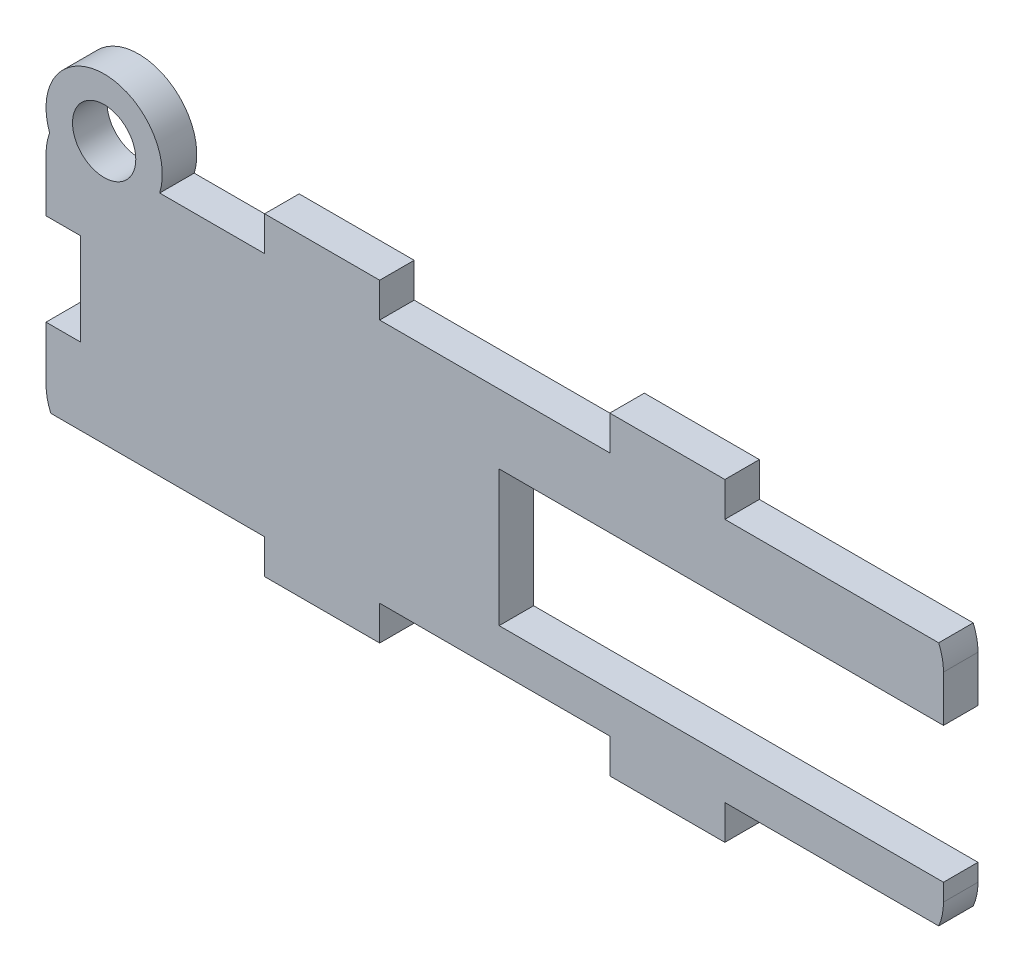
ISO-10303-21;
HEADER;
FILE_DESCRIPTION(('STEP AP214'),'2;1');
FILE_NAME('part.step','',(''),(''),'','','');
FILE_SCHEMA(('AUTOMOTIVE_DESIGN { 1 0 10303 214 1 1 1 1 }'));
ENDSEC;
DATA;
#1=APPLICATION_CONTEXT('core data for automotive mechanical design processes');
#2=APPLICATION_PROTOCOL_DEFINITION('international standard','automotive_design',2000,#1);
#3=PRODUCT_CONTEXT('',#1,'mechanical');
#4=PRODUCT('Part','Part','',(#3));
#5=PRODUCT_RELATED_PRODUCT_CATEGORY('part','',(#4));
#6=PRODUCT_DEFINITION_FORMATION('','',#4);
#7=PRODUCT_DEFINITION_CONTEXT('part definition',#1,'design');
#8=PRODUCT_DEFINITION('design','',#6,#7);
#9=PRODUCT_DEFINITION_SHAPE('','',#8);
#10=(LENGTH_UNIT() NAMED_UNIT(*) SI_UNIT(.MILLI.,.METRE.));
#11=(NAMED_UNIT(*) PLANE_ANGLE_UNIT() SI_UNIT($,.RADIAN.));
#12=(NAMED_UNIT(*) SI_UNIT($,.STERADIAN.) SOLID_ANGLE_UNIT());
#13=UNCERTAINTY_MEASURE_WITH_UNIT(LENGTH_MEASURE(1.E-05),#10,'distance_accuracy_value','');
#14=(GEOMETRIC_REPRESENTATION_CONTEXT(3) GLOBAL_UNCERTAINTY_ASSIGNED_CONTEXT((#13)) GLOBAL_UNIT_ASSIGNED_CONTEXT((#10,
#11,#12)) REPRESENTATION_CONTEXT('',''));
#15=CARTESIAN_POINT('',(0.,0.,0.));
#16=DIRECTION('',(0.,0.,1.));
#17=DIRECTION('',(1.,0.,0.));
#18=AXIS2_PLACEMENT_3D('',#15,#16,#17);
#19=CARTESIAN_POINT('',(-26.,2.00000000000004,3.));
#20=DIRECTION('',(1.,0.,0.));
#21=DIRECTION('',(0.,0.,-1.));
#22=AXIS2_PLACEMENT_3D('',#19,#20,#21);
#23=PLANE('',#22);
#24=DIRECTION('',(0.,0.,1.));
#25=VECTOR('',#24,1.);
#26=CARTESIAN_POINT('',(-26.,6.65592079454651,0.));
#27=LINE('',#26,#25);
#28=CARTESIAN_POINT('',(-26.,6.65592079454651,0.));
#29=VERTEX_POINT('',#28);
#30=CARTESIAN_POINT('',(-26.,6.65592079454651,3.));
#31=VERTEX_POINT('',#30);
#32=EDGE_CURVE('E252',#29,#31,#27,.T.);
#33=ORIENTED_EDGE('',*,*,#32,.F.);
#34=DIRECTION('',(0.,-1.,0.));
#35=VECTOR('',#34,1.);
#36=CARTESIAN_POINT('',(-26.,2.00000000000004,0.));
#37=LINE('',#36,#35);
#38=CARTESIAN_POINT('',(-26.,2.,0.));
#39=VERTEX_POINT('',#38);
#40=EDGE_CURVE('E264',#29,#39,#37,.T.);
#41=ORIENTED_EDGE('',*,*,#40,.T.);
#42=DIRECTION('',(0.,0.,-1.));
#43=VECTOR('',#42,1.);
#44=CARTESIAN_POINT('',(-26.,2.,3.));
#45=LINE('',#44,#43);
#46=CARTESIAN_POINT('',(-26.,2.,3.));
#47=VERTEX_POINT('',#46);
#48=EDGE_CURVE('E360',#47,#39,#45,.T.);
#49=ORIENTED_EDGE('',*,*,#48,.F.);
#50=DIRECTION('',(0.,-1.,0.));
#51=VECTOR('',#50,1.);
#52=CARTESIAN_POINT('',(-26.,2.00000000000004,3.));
#53=LINE('',#52,#51);
#54=EDGE_CURVE('E266',#31,#47,#53,.T.);
#55=ORIENTED_EDGE('',*,*,#54,.F.);
#56=EDGE_LOOP('',(#33,#41,#49,#55));
#57=FACE_BOUND('',#56,.T.);
#58=ADVANCED_FACE('F33',(#57),#23,.F.);
#59=CARTESIAN_POINT('',(47.,19.311841589093,3.));
#60=DIRECTION('',(0.,0.,-1.));
#61=DIRECTION('',(-1.,0.,0.));
#62=AXIS2_PLACEMENT_3D('',#59,#60,#61);
#63=PLANE('',#62);
#64=CARTESIAN_POINT('',(-20.9460971389768,22.811841589093,3.));
#65=DIRECTION('',(0.,0.,1.));
#66=DIRECTION('',(1.,0.,0.));
#67=AXIS2_PLACEMENT_3D('',#64,#65,#66);
#68=CIRCLE('',#67,2.75);
#69=CARTESIAN_POINT('',(-18.1960971389768,22.811841589093,3.));
#70=VERTEX_POINT('',#69);
#71=EDGE_CURVE('E267',#70,#70,#68,.T.);
#72=ORIENTED_EDGE('',*,*,#71,.F.);
#73=EDGE_LOOP('',(#72));
#74=FACE_BOUND('',#73,.T.);
#75=DIRECTION('',(-1.,0.,0.));
#76=VECTOR('',#75,1.);
#77=CARTESIAN_POINT('',(-23.0000000000001,6.65592079454651,3.));
#78=LINE('',#77,#76);
#79=CARTESIAN_POINT('',(-23.0000000000001,6.65592079454651,3.));
#80=VERTEX_POINT('',#79);
#81=EDGE_CURVE('E592',#80,#31,#78,.T.);
#82=ORIENTED_EDGE('',*,*,#81,.T.);
#83=ORIENTED_EDGE('',*,*,#54,.T.);
#84=CARTESIAN_POINT('',(-21.,2.,3.));
#85=DIRECTION('',(0.,0.,1.));
#86=DIRECTION('',(-1.,0.,0.));
#87=AXIS2_PLACEMENT_3D('',#84,#85,#86);
#88=CIRCLE('',#87,5.);
#89=CARTESIAN_POINT('',(-25.5825756949558,0.,3.));
#90=VERTEX_POINT('',#89);
#91=EDGE_CURVE('E468',#47,#90,#88,.T.);
#92=ORIENTED_EDGE('',*,*,#91,.T.);
#93=DIRECTION('',(1.,0.,0.));
#94=VECTOR('',#93,1.);
#95=CARTESIAN_POINT('',(-6.99999999999999,0.,3.));
#96=LINE('',#95,#94);
#97=CARTESIAN_POINT('',(-6.99999999999999,0.,3.));
#98=VERTEX_POINT('',#97);
#99=EDGE_CURVE('E470',#90,#98,#96,.T.);
#100=ORIENTED_EDGE('',*,*,#99,.T.);
#101=DIRECTION('',(0.,-1.,0.));
#102=VECTOR('',#101,1.);
#103=CARTESIAN_POINT('',(-6.99999999999999,0.,3.));
#104=LINE('',#103,#102);
#105=CARTESIAN_POINT('',(-6.99999999999999,-3.,3.));
#106=VERTEX_POINT('',#105);
#107=EDGE_CURVE('E472',#98,#106,#104,.T.);
#108=ORIENTED_EDGE('',*,*,#107,.T.);
#109=DIRECTION('',(1.,0.,0.));
#110=VECTOR('',#109,1.);
#111=CARTESIAN_POINT('',(-6.99999999999999,-3.,3.));
#112=LINE('',#111,#110);
#113=CARTESIAN_POINT('',(3.00000000000001,-3.,3.));
#114=VERTEX_POINT('',#113);
#115=EDGE_CURVE('E474',#106,#114,#112,.T.);
#116=ORIENTED_EDGE('',*,*,#115,.T.);
#117=DIRECTION('',(0.,1.,0.));
#118=VECTOR('',#117,1.);
#119=CARTESIAN_POINT('',(3.00000000000001,-3.,3.));
#120=LINE('',#119,#118);
#121=CARTESIAN_POINT('',(3.00000000000001,0.,3.));
#122=VERTEX_POINT('',#121);
#123=EDGE_CURVE('E476',#114,#122,#120,.T.);
#124=ORIENTED_EDGE('',*,*,#123,.T.);
#125=DIRECTION('',(1.,0.,0.));
#126=VECTOR('',#125,1.);
#127=CARTESIAN_POINT('',(3.00000000000001,0.,3.));
#128=LINE('',#127,#126);
#129=CARTESIAN_POINT('',(23.,0.,3.));
#130=VERTEX_POINT('',#129);
#131=EDGE_CURVE('E478',#122,#130,#128,.T.);
#132=ORIENTED_EDGE('',*,*,#131,.T.);
#133=DIRECTION('',(0.,-1.,0.));
#134=VECTOR('',#133,1.);
#135=CARTESIAN_POINT('',(23.,-3.,3.));
#136=LINE('',#135,#134);
#137=CARTESIAN_POINT('',(23.,-3.,3.));
#138=VERTEX_POINT('',#137);
#139=EDGE_CURVE('E480',#130,#138,#136,.T.);
#140=ORIENTED_EDGE('',*,*,#139,.T.);
#141=DIRECTION('',(1.,0.,0.));
#142=VECTOR('',#141,1.);
#143=CARTESIAN_POINT('',(23.,-3.,3.));
#144=LINE('',#143,#142);
#145=CARTESIAN_POINT('',(33.,-3.,3.));
#146=VERTEX_POINT('',#145);
#147=EDGE_CURVE('E482',#138,#146,#144,.T.);
#148=ORIENTED_EDGE('',*,*,#147,.T.);
#149=DIRECTION('',(0.,1.,0.));
#150=VECTOR('',#149,1.);
#151=CARTESIAN_POINT('',(33.,-3.,3.));
#152=LINE('',#151,#150);
#153=CARTESIAN_POINT('',(33.,0.,3.));
#154=VERTEX_POINT('',#153);
#155=EDGE_CURVE('E484',#146,#154,#152,.T.);
#156=ORIENTED_EDGE('',*,*,#155,.T.);
#157=DIRECTION('',(1.,0.,0.));
#158=VECTOR('',#157,1.);
#159=CARTESIAN_POINT('',(33.,0.,3.));
#160=LINE('',#159,#158);
#161=CARTESIAN_POINT('',(51.5825756949558,0.,3.));
#162=VERTEX_POINT('',#161);
#163=EDGE_CURVE('E486',#154,#162,#160,.T.);
#164=ORIENTED_EDGE('',*,*,#163,.T.);
#165=CARTESIAN_POINT('',(47.,2.,3.));
#166=DIRECTION('',(0.,0.,1.));
#167=DIRECTION('',(1.,0.,0.));
#168=AXIS2_PLACEMENT_3D('',#165,#166,#167);
#169=CIRCLE('',#168,5.);
#170=CARTESIAN_POINT('',(52.,2.00000000000004,3.));
#171=VERTEX_POINT('',#170);
#172=EDGE_CURVE('E488',#162,#171,#169,.T.);
#173=ORIENTED_EDGE('',*,*,#172,.T.);
#174=DIRECTION('',(0.,1.,0.));
#175=VECTOR('',#174,1.);
#176=CARTESIAN_POINT('',(52.,2.00000000000004,3.));
#177=LINE('',#176,#175);
#178=CARTESIAN_POINT('',(52.,3.5,3.));
#179=VERTEX_POINT('',#178);
#180=EDGE_CURVE('E491',#171,#179,#177,.T.);
#181=ORIENTED_EDGE('',*,*,#180,.T.);
#182=DIRECTION('',(1.,0.,0.));
#183=VECTOR('',#182,1.);
#184=CARTESIAN_POINT('',(13.38,3.49999999999997,3.));
#185=LINE('',#184,#183);
#186=CARTESIAN_POINT('',(13.38,3.49999999999997,3.));
#187=VERTEX_POINT('',#186);
#188=EDGE_CURVE('E433',#187,#179,#185,.T.);
#189=ORIENTED_EDGE('',*,*,#188,.F.);
#190=DIRECTION('',(0.,-1.,0.));
#191=VECTOR('',#190,1.);
#192=CARTESIAN_POINT('',(13.38,3.49999999999997,3.));
#193=LINE('',#192,#191);
#194=CARTESIAN_POINT('',(13.38,15.3,3.));
#195=VERTEX_POINT('',#194);
#196=EDGE_CURVE('E438',#195,#187,#193,.T.);
#197=ORIENTED_EDGE('',*,*,#196,.F.);
#198=DIRECTION('',(-1.,0.,0.));
#199=VECTOR('',#198,1.);
#200=CARTESIAN_POINT('',(13.38,15.3,3.));
#201=LINE('',#200,#199);
#202=CARTESIAN_POINT('',(52.,15.3,3.));
#203=VERTEX_POINT('',#202);
#204=EDGE_CURVE('E435',#203,#195,#201,.T.);
#205=ORIENTED_EDGE('',*,*,#204,.F.);
#206=CARTESIAN_POINT('',(52.,19.311841589093,3.));
#207=VERTEX_POINT('',#206);
#208=EDGE_CURVE('E490',#203,#207,#177,.T.);
#209=ORIENTED_EDGE('',*,*,#208,.T.);
#210=CARTESIAN_POINT('',(47.,19.311841589093,3.));
#211=DIRECTION('',(0.,0.,1.));
#212=DIRECTION('',(-1.,0.,0.));
#213=AXIS2_PLACEMENT_3D('',#210,#211,#212);
#214=CIRCLE('',#213,5.);
#215=CARTESIAN_POINT('',(51.5825756949558,21.311841589093,3.));
#216=VERTEX_POINT('',#215);
#217=EDGE_CURVE('E494',#207,#216,#214,.T.);
#218=ORIENTED_EDGE('',*,*,#217,.T.);
#219=DIRECTION('',(-1.,0.,0.));
#220=VECTOR('',#219,1.);
#221=CARTESIAN_POINT('',(33.,21.311841589093,3.));
#222=LINE('',#221,#220);
#223=CARTESIAN_POINT('',(33.,21.311841589093,3.));
#224=VERTEX_POINT('',#223);
#225=EDGE_CURVE('E496',#216,#224,#222,.T.);
#226=ORIENTED_EDGE('',*,*,#225,.T.);
#227=DIRECTION('',(0.,1.,0.));
#228=VECTOR('',#227,1.);
#229=CARTESIAN_POINT('',(33.,24.311841589093,3.));
#230=LINE('',#229,#228);
#231=CARTESIAN_POINT('',(33.,24.311841589093,3.));
#232=VERTEX_POINT('',#231);
#233=EDGE_CURVE('E318',#224,#232,#230,.T.);
#234=ORIENTED_EDGE('',*,*,#233,.T.);
#235=DIRECTION('',(-1.,0.,0.));
#236=VECTOR('',#235,1.);
#237=CARTESIAN_POINT('',(23.,24.311841589093,3.));
#238=LINE('',#237,#236);
#239=CARTESIAN_POINT('',(23.,24.311841589093,3.));
#240=VERTEX_POINT('',#239);
#241=EDGE_CURVE('E313',#232,#240,#238,.T.);
#242=ORIENTED_EDGE('',*,*,#241,.T.);
#243=DIRECTION('',(0.,-1.,0.));
#244=VECTOR('',#243,1.);
#245=CARTESIAN_POINT('',(23.,24.311841589093,3.));
#246=LINE('',#245,#244);
#247=CARTESIAN_POINT('',(23.,21.311841589093,3.));
#248=VERTEX_POINT('',#247);
#249=EDGE_CURVE('E452',#240,#248,#246,.T.);
#250=ORIENTED_EDGE('',*,*,#249,.T.);
#251=DIRECTION('',(-1.,0.,0.));
#252=VECTOR('',#251,1.);
#253=CARTESIAN_POINT('',(3.00000000000001,21.311841589093,3.));
#254=LINE('',#253,#252);
#255=CARTESIAN_POINT('',(3.00000000000001,21.311841589093,3.));
#256=VERTEX_POINT('',#255);
#257=EDGE_CURVE('E384',#248,#256,#254,.T.);
#258=ORIENTED_EDGE('',*,*,#257,.T.);
#259=DIRECTION('',(0.,1.,0.));
#260=VECTOR('',#259,1.);
#261=CARTESIAN_POINT('',(3.00000000000001,24.311841589093,3.));
#262=LINE('',#261,#260);
#263=CARTESIAN_POINT('',(3.00000000000001,24.311841589093,3.));
#264=VERTEX_POINT('',#263);
#265=EDGE_CURVE('E455',#256,#264,#262,.T.);
#266=ORIENTED_EDGE('',*,*,#265,.T.);
#267=DIRECTION('',(-1.,0.,0.));
#268=VECTOR('',#267,1.);
#269=CARTESIAN_POINT('',(-6.99999999999999,24.311841589093,3.));
#270=LINE('',#269,#268);
#271=CARTESIAN_POINT('',(-6.99999999999999,24.311841589093,3.));
#272=VERTEX_POINT('',#271);
#273=EDGE_CURVE('E457',#264,#272,#270,.T.);
#274=ORIENTED_EDGE('',*,*,#273,.T.);
#275=DIRECTION('',(0.,-1.,0.));
#276=VECTOR('',#275,1.);
#277=CARTESIAN_POINT('',(-6.99999999999999,21.311841589093,3.));
#278=LINE('',#277,#276);
#279=CARTESIAN_POINT('',(-6.99999999999999,21.311841589093,3.));
#280=VERTEX_POINT('',#279);
#281=EDGE_CURVE('E459',#272,#280,#278,.T.);
#282=ORIENTED_EDGE('',*,*,#281,.T.);
#283=DIRECTION('',(-1.,0.,0.));
#284=VECTOR('',#283,1.);
#285=CARTESIAN_POINT('',(-6.99999999999999,21.311841589093,3.));
#286=LINE('',#285,#284);
#287=CARTESIAN_POINT('',(-16.1199253508347,21.311841589093,3.));
#288=VERTEX_POINT('',#287);
#289=EDGE_CURVE('E461',#280,#288,#286,.T.);
#290=ORIENTED_EDGE('',*,*,#289,.T.);
#291=CARTESIAN_POINT('',(-20.9460971389768,22.811841589093,3.));
#292=DIRECTION('',(0.,0.,1.));
#293=DIRECTION('',(1.,0.,0.));
#294=AXIS2_PLACEMENT_3D('',#291,#292,#293);
#295=CIRCLE('',#294,5.05390286102321);
#296=CARTESIAN_POINT('',(-25.6855550398169,21.0569988796678,3.));
#297=VERTEX_POINT('',#296);
#298=EDGE_CURVE('E56',#288,#297,#295,.T.);
#299=ORIENTED_EDGE('',*,*,#298,.T.);
#300=CARTESIAN_POINT('',(-21.,19.311841589093,3.));
#301=DIRECTION('',(0.,0.,1.));
#302=DIRECTION('',(-1.,0.,0.));
#303=AXIS2_PLACEMENT_3D('',#300,#301,#302);
#304=CIRCLE('',#303,5.);
#305=CARTESIAN_POINT('',(-26.,19.311841589093,3.));
#306=VERTEX_POINT('',#305);
#307=EDGE_CURVE('E463',#297,#306,#304,.T.);
#308=ORIENTED_EDGE('',*,*,#307,.T.);
#309=CARTESIAN_POINT('',(-26.,14.6559207945465,3.));
#310=VERTEX_POINT('',#309);
#311=EDGE_CURVE('E465',#306,#310,#53,.T.);
#312=ORIENTED_EDGE('',*,*,#311,.T.);
#313=DIRECTION('',(-1.,0.,0.));
#314=VECTOR('',#313,1.);
#315=CARTESIAN_POINT('',(-23.0000000000001,14.6559207945465,3.));
#316=LINE('',#315,#314);
#317=CARTESIAN_POINT('',(-23.0000000000001,14.6559207945465,3.));
#318=VERTEX_POINT('',#317);
#319=EDGE_CURVE('E595',#318,#310,#316,.T.);
#320=ORIENTED_EDGE('',*,*,#319,.F.);
#321=DIRECTION('',(0.,1.,0.));
#322=VECTOR('',#321,1.);
#323=CARTESIAN_POINT('',(-23.0000000000001,6.65592079454651,3.));
#324=LINE('',#323,#322);
#325=EDGE_CURVE('E259',#80,#318,#324,.T.);
#326=ORIENTED_EDGE('',*,*,#325,.F.);
#327=EDGE_LOOP('',(#82,#83,#92,#100,#108,#116,#124,#132,#140,#148,#156,#164,#173,#181,#189,#197,
#205,#209,#218,#226,#234,#242,#250,#258,#266,#274,#282,#290,#299,#308,#312,#320,#326));
#328=FACE_BOUND('',#327,.T.);
#329=ADVANCED_FACE('F527',(#74,#328),#63,.F.);
#330=CARTESIAN_POINT('',(47.,19.311841589093,0.));
#331=DIRECTION('',(0.,0.,-1.));
#332=DIRECTION('',(-1.,0.,0.));
#333=AXIS2_PLACEMENT_3D('',#330,#331,#332);
#334=PLANE('',#333);
#335=CARTESIAN_POINT('',(-20.9460971389768,22.811841589093,0.));
#336=DIRECTION('',(0.,0.,1.));
#337=DIRECTION('',(1.,0.,0.));
#338=AXIS2_PLACEMENT_3D('',#335,#336,#337);
#339=CIRCLE('',#338,2.75);
#340=CARTESIAN_POINT('',(-18.1960971389768,22.811841589093,0.));
#341=VERTEX_POINT('',#340);
#342=EDGE_CURVE('E420',#341,#341,#339,.T.);
#343=ORIENTED_EDGE('',*,*,#342,.T.);
#344=EDGE_LOOP('',(#343));
#345=FACE_BOUND('',#344,.T.);
#346=ORIENTED_EDGE('',*,*,#40,.F.);
#347=DIRECTION('',(-1.,0.,0.));
#348=VECTOR('',#347,1.);
#349=CARTESIAN_POINT('',(-23.0000000000001,6.65592079454651,0.));
#350=LINE('',#349,#348);
#351=CARTESIAN_POINT('',(-23.0000000000001,6.65592079454651,0.));
#352=VERTEX_POINT('',#351);
#353=EDGE_CURVE('E248',#352,#29,#350,.T.);
#354=ORIENTED_EDGE('',*,*,#353,.F.);
#355=DIRECTION('',(0.,1.,0.));
#356=VECTOR('',#355,1.);
#357=CARTESIAN_POINT('',(-23.0000000000001,6.65592079454651,0.));
#358=LINE('',#357,#356);
#359=CARTESIAN_POINT('',(-23.0000000000001,14.6559207945465,0.));
#360=VERTEX_POINT('',#359);
#361=EDGE_CURVE('E599',#352,#360,#358,.T.);
#362=ORIENTED_EDGE('',*,*,#361,.T.);
#363=DIRECTION('',(-1.,0.,0.));
#364=VECTOR('',#363,1.);
#365=CARTESIAN_POINT('',(-23.0000000000001,14.6559207945465,0.));
#366=LINE('',#365,#364);
#367=CARTESIAN_POINT('',(-26.,14.6559207945465,0.));
#368=VERTEX_POINT('',#367);
#369=EDGE_CURVE('E48',#360,#368,#366,.T.);
#370=ORIENTED_EDGE('',*,*,#369,.T.);
#371=CARTESIAN_POINT('',(-26.,19.311841589093,0.));
#372=VERTEX_POINT('',#371);
#373=EDGE_CURVE('E274',#372,#368,#37,.T.);
#374=ORIENTED_EDGE('',*,*,#373,.F.);
#375=CARTESIAN_POINT('',(-21.,19.311841589093,0.));
#376=DIRECTION('',(0.,0.,1.));
#377=DIRECTION('',(-1.,0.,0.));
#378=AXIS2_PLACEMENT_3D('',#375,#376,#377);
#379=CIRCLE('',#378,5.);
#380=CARTESIAN_POINT('',(-25.6855550398169,21.0569988796678,0.));
#381=VERTEX_POINT('',#380);
#382=EDGE_CURVE('E275',#381,#372,#379,.T.);
#383=ORIENTED_EDGE('',*,*,#382,.F.);
#384=CARTESIAN_POINT('',(-20.9460971389768,22.811841589093,0.));
#385=DIRECTION('',(0.,0.,1.));
#386=DIRECTION('',(1.,0.,0.));
#387=AXIS2_PLACEMENT_3D('',#384,#385,#386);
#388=CIRCLE('',#387,5.05390286102321);
#389=CARTESIAN_POINT('',(-16.1199253508347,21.311841589093,0.));
#390=VERTEX_POINT('',#389);
#391=EDGE_CURVE('E411',#390,#381,#388,.T.);
#392=ORIENTED_EDGE('',*,*,#391,.F.);
#393=DIRECTION('',(-1.,0.,0.));
#394=VECTOR('',#393,1.);
#395=CARTESIAN_POINT('',(-6.99999999999999,21.311841589093,0.));
#396=LINE('',#395,#394);
#397=CARTESIAN_POINT('',(-6.99999999999999,21.311841589093,0.));
#398=VERTEX_POINT('',#397);
#399=EDGE_CURVE('E278',#398,#390,#396,.T.);
#400=ORIENTED_EDGE('',*,*,#399,.F.);
#401=DIRECTION('',(0.,-1.,0.));
#402=VECTOR('',#401,1.);
#403=CARTESIAN_POINT('',(-6.99999999999999,21.311841589093,0.));
#404=LINE('',#403,#402);
#405=CARTESIAN_POINT('',(-6.99999999999999,24.311841589093,0.));
#406=VERTEX_POINT('',#405);
#407=EDGE_CURVE('E399',#406,#398,#404,.T.);
#408=ORIENTED_EDGE('',*,*,#407,.F.);
#409=DIRECTION('',(-1.,0.,0.));
#410=VECTOR('',#409,1.);
#411=CARTESIAN_POINT('',(-6.99999999999999,24.311841589093,0.));
#412=LINE('',#411,#410);
#413=CARTESIAN_POINT('',(3.00000000000001,24.311841589093,0.));
#414=VERTEX_POINT('',#413);
#415=EDGE_CURVE('E392',#414,#406,#412,.T.);
#416=ORIENTED_EDGE('',*,*,#415,.F.);
#417=DIRECTION('',(0.,1.,0.));
#418=VECTOR('',#417,1.);
#419=CARTESIAN_POINT('',(3.00000000000001,24.311841589093,0.));
#420=LINE('',#419,#418);
#421=CARTESIAN_POINT('',(3.00000000000001,21.311841589093,0.));
#422=VERTEX_POINT('',#421);
#423=EDGE_CURVE('E390',#422,#414,#420,.T.);
#424=ORIENTED_EDGE('',*,*,#423,.F.);
#425=DIRECTION('',(-1.,0.,0.));
#426=VECTOR('',#425,1.);
#427=CARTESIAN_POINT('',(3.00000000000001,21.311841589093,0.));
#428=LINE('',#427,#426);
#429=CARTESIAN_POINT('',(23.,21.311841589093,0.));
#430=VERTEX_POINT('',#429);
#431=EDGE_CURVE('E383',#430,#422,#428,.T.);
#432=ORIENTED_EDGE('',*,*,#431,.F.);
#433=DIRECTION('',(0.,-1.,0.));
#434=VECTOR('',#433,1.);
#435=CARTESIAN_POINT('',(23.,24.311841589093,0.));
#436=LINE('',#435,#434);
#437=CARTESIAN_POINT('',(23.,24.311841589093,0.));
#438=VERTEX_POINT('',#437);
#439=EDGE_CURVE('E388',#438,#430,#436,.T.);
#440=ORIENTED_EDGE('',*,*,#439,.F.);
#441=DIRECTION('',(-1.,0.,0.));
#442=VECTOR('',#441,1.);
#443=CARTESIAN_POINT('',(23.,24.311841589093,0.));
#444=LINE('',#443,#442);
#445=CARTESIAN_POINT('',(33.,24.311841589093,0.));
#446=VERTEX_POINT('',#445);
#447=EDGE_CURVE('E394',#446,#438,#444,.T.);
#448=ORIENTED_EDGE('',*,*,#447,.F.);
#449=DIRECTION('',(0.,1.,0.));
#450=VECTOR('',#449,1.);
#451=CARTESIAN_POINT('',(33.,24.311841589093,0.));
#452=LINE('',#451,#450);
#453=CARTESIAN_POINT('',(33.,21.311841589093,0.));
#454=VERTEX_POINT('',#453);
#455=EDGE_CURVE('E311',#454,#446,#452,.T.);
#456=ORIENTED_EDGE('',*,*,#455,.F.);
#457=DIRECTION('',(-1.,0.,0.));
#458=VECTOR('',#457,1.);
#459=CARTESIAN_POINT('',(33.,21.311841589093,0.));
#460=LINE('',#459,#458);
#461=CARTESIAN_POINT('',(51.5825756949558,21.311841589093,0.));
#462=VERTEX_POINT('',#461);
#463=EDGE_CURVE('E309',#462,#454,#460,.T.);
#464=ORIENTED_EDGE('',*,*,#463,.F.);
#465=CARTESIAN_POINT('',(47.,19.311841589093,0.));
#466=DIRECTION('',(0.,0.,1.));
#467=DIRECTION('',(-1.,0.,0.));
#468=AXIS2_PLACEMENT_3D('',#465,#466,#467);
#469=CIRCLE('',#468,5.);
#470=CARTESIAN_POINT('',(52.,19.311841589093,0.));
#471=VERTEX_POINT('',#470);
#472=EDGE_CURVE('E307',#471,#462,#469,.T.);
#473=ORIENTED_EDGE('',*,*,#472,.F.);
#474=DIRECTION('',(0.,1.,0.));
#475=VECTOR('',#474,1.);
#476=CARTESIAN_POINT('',(52.,2.00000000000004,0.));
#477=LINE('',#476,#475);
#478=CARTESIAN_POINT('',(52.,15.3,0.));
#479=VERTEX_POINT('',#478);
#480=EDGE_CURVE('E303',#479,#471,#477,.T.);
#481=ORIENTED_EDGE('',*,*,#480,.F.);
#482=DIRECTION('',(-1.,0.,0.));
#483=VECTOR('',#482,1.);
#484=CARTESIAN_POINT('',(13.38,15.3,0.));
#485=LINE('',#484,#483);
#486=CARTESIAN_POINT('',(13.38,15.3,0.));
#487=VERTEX_POINT('',#486);
#488=EDGE_CURVE('E413',#479,#487,#485,.T.);
#489=ORIENTED_EDGE('',*,*,#488,.T.);
#490=DIRECTION('',(0.,-1.,0.));
#491=VECTOR('',#490,1.);
#492=CARTESIAN_POINT('',(13.38,3.49999999999997,0.));
#493=LINE('',#492,#491);
#494=CARTESIAN_POINT('',(13.38,3.49999999999997,0.));
#495=VERTEX_POINT('',#494);
#496=EDGE_CURVE('E427',#487,#495,#493,.T.);
#497=ORIENTED_EDGE('',*,*,#496,.T.);
#498=DIRECTION('',(1.,0.,0.));
#499=VECTOR('',#498,1.);
#500=CARTESIAN_POINT('',(13.38,3.49999999999997,0.));
#501=LINE('',#500,#499);
#502=CARTESIAN_POINT('',(52.,3.5,0.));
#503=VERTEX_POINT('',#502);
#504=EDGE_CURVE('E430',#495,#503,#501,.T.);
#505=ORIENTED_EDGE('',*,*,#504,.T.);
#506=CARTESIAN_POINT('',(52.,2.00000000000004,0.));
#507=VERTEX_POINT('',#506);
#508=EDGE_CURVE('E304',#507,#503,#477,.T.);
#509=ORIENTED_EDGE('',*,*,#508,.F.);
#510=CARTESIAN_POINT('',(47.,2.,0.));
#511=DIRECTION('',(0.,0.,1.));
#512=DIRECTION('',(1.,0.,0.));
#513=AXIS2_PLACEMENT_3D('',#510,#511,#512);
#514=CIRCLE('',#513,5.);
#515=CARTESIAN_POINT('',(51.5825756949558,0.,0.));
#516=VERTEX_POINT('',#515);
#517=EDGE_CURVE('E301',#516,#507,#514,.T.);
#518=ORIENTED_EDGE('',*,*,#517,.F.);
#519=DIRECTION('',(1.,0.,0.));
#520=VECTOR('',#519,1.);
#521=CARTESIAN_POINT('',(33.,0.,0.));
#522=LINE('',#521,#520);
#523=CARTESIAN_POINT('',(33.,0.,0.));
#524=VERTEX_POINT('',#523);
#525=EDGE_CURVE('E299',#524,#516,#522,.T.);
#526=ORIENTED_EDGE('',*,*,#525,.F.);
#527=DIRECTION('',(0.,1.,0.));
#528=VECTOR('',#527,1.);
#529=CARTESIAN_POINT('',(33.,-3.,0.));
#530=LINE('',#529,#528);
#531=CARTESIAN_POINT('',(33.,-3.,0.));
#532=VERTEX_POINT('',#531);
#533=EDGE_CURVE('E297',#532,#524,#530,.T.);
#534=ORIENTED_EDGE('',*,*,#533,.F.);
#535=DIRECTION('',(1.,0.,0.));
#536=VECTOR('',#535,1.);
#537=CARTESIAN_POINT('',(23.,-3.,0.));
#538=LINE('',#537,#536);
#539=CARTESIAN_POINT('',(23.,-3.,0.));
#540=VERTEX_POINT('',#539);
#541=EDGE_CURVE('E295',#540,#532,#538,.T.);
#542=ORIENTED_EDGE('',*,*,#541,.F.);
#543=DIRECTION('',(0.,-1.,0.));
#544=VECTOR('',#543,1.);
#545=CARTESIAN_POINT('',(23.,-3.,0.));
#546=LINE('',#545,#544);
#547=CARTESIAN_POINT('',(23.,0.,0.));
#548=VERTEX_POINT('',#547);
#549=EDGE_CURVE('E293',#548,#540,#546,.T.);
#550=ORIENTED_EDGE('',*,*,#549,.F.);
#551=DIRECTION('',(1.,0.,0.));
#552=VECTOR('',#551,1.);
#553=CARTESIAN_POINT('',(3.00000000000001,0.,0.));
#554=LINE('',#553,#552);
#555=CARTESIAN_POINT('',(3.00000000000001,0.,0.));
#556=VERTEX_POINT('',#555);
#557=EDGE_CURVE('E291',#556,#548,#554,.T.);
#558=ORIENTED_EDGE('',*,*,#557,.F.);
#559=DIRECTION('',(0.,1.,0.));
#560=VECTOR('',#559,1.);
#561=CARTESIAN_POINT('',(3.00000000000001,-3.,0.));
#562=LINE('',#561,#560);
#563=CARTESIAN_POINT('',(3.00000000000001,-3.,0.));
#564=VERTEX_POINT('',#563);
#565=EDGE_CURVE('E289',#564,#556,#562,.T.);
#566=ORIENTED_EDGE('',*,*,#565,.F.);
#567=DIRECTION('',(1.,0.,0.));
#568=VECTOR('',#567,1.);
#569=CARTESIAN_POINT('',(-6.99999999999999,-3.,0.));
#570=LINE('',#569,#568);
#571=CARTESIAN_POINT('',(-6.99999999999999,-3.,0.));
#572=VERTEX_POINT('',#571);
#573=EDGE_CURVE('E287',#572,#564,#570,.T.);
#574=ORIENTED_EDGE('',*,*,#573,.F.);
#575=DIRECTION('',(0.,-1.,0.));
#576=VECTOR('',#575,1.);
#577=CARTESIAN_POINT('',(-6.99999999999999,0.,0.));
#578=LINE('',#577,#576);
#579=CARTESIAN_POINT('',(-6.99999999999999,0.,0.));
#580=VERTEX_POINT('',#579);
#581=EDGE_CURVE('E285',#580,#572,#578,.T.);
#582=ORIENTED_EDGE('',*,*,#581,.F.);
#583=DIRECTION('',(1.,0.,0.));
#584=VECTOR('',#583,1.);
#585=CARTESIAN_POINT('',(-6.99999999999999,0.,0.));
#586=LINE('',#585,#584);
#587=CARTESIAN_POINT('',(-25.5825756949558,0.,0.));
#588=VERTEX_POINT('',#587);
#589=EDGE_CURVE('E283',#588,#580,#586,.T.);
#590=ORIENTED_EDGE('',*,*,#589,.F.);
#591=CARTESIAN_POINT('',(-21.,2.,0.));
#592=DIRECTION('',(0.,0.,1.));
#593=DIRECTION('',(-1.,0.,0.));
#594=AXIS2_PLACEMENT_3D('',#591,#592,#593);
#595=CIRCLE('',#594,5.);
#596=EDGE_CURVE('E273',#39,#588,#595,.T.);
#597=ORIENTED_EDGE('',*,*,#596,.F.);
#598=EDGE_LOOP('',(#346,#354,#362,#370,#374,#383,#392,#400,#408,#416,#424,#432,#440,#448,#456,
#464,#473,#481,#489,#497,#505,#509,#518,#526,#534,#542,#550,#558,#566,#574,#582,#590,#597));
#599=FACE_BOUND('',#598,.T.);
#600=ADVANCED_FACE('F271',(#345,#599),#334,.T.);
#601=CARTESIAN_POINT('',(-6.99999999999999,21.311841589093,3.));
#602=DIRECTION('',(0.,-1.,0.));
#603=DIRECTION('',(0.,0.,-1.));
#604=AXIS2_PLACEMENT_3D('',#601,#602,#603);
#605=PLANE('',#604);
#606=ORIENTED_EDGE('',*,*,#399,.T.);
#607=DIRECTION('',(0.,0.,1.));
#608=VECTOR('',#607,1.);
#609=CARTESIAN_POINT('',(-16.1199253508347,21.311841589093,0.));
#610=LINE('',#609,#608);
#611=EDGE_CURVE('E405',#390,#288,#610,.T.);
#612=ORIENTED_EDGE('',*,*,#611,.T.);
#613=ORIENTED_EDGE('',*,*,#289,.F.);
#614=DIRECTION('',(0.,0.,-1.));
#615=VECTOR('',#614,1.);
#616=CARTESIAN_POINT('',(-6.99999999999999,21.311841589093,3.));
#617=LINE('',#616,#615);
#618=EDGE_CURVE('E365',#280,#398,#617,.T.);
#619=ORIENTED_EDGE('',*,*,#618,.T.);
#620=EDGE_LOOP('',(#606,#612,#613,#619));
#621=FACE_BOUND('',#620,.T.);
#622=ADVANCED_FACE('F403',(#621),#605,.F.);
#623=CARTESIAN_POINT('',(52.,2.00000000000004,3.));
#624=DIRECTION('',(-1.,0.,0.));
#625=DIRECTION('',(0.,0.,1.));
#626=AXIS2_PLACEMENT_3D('',#623,#624,#625);
#627=PLANE('',#626);
#628=ORIENTED_EDGE('',*,*,#508,.T.);
#629=DIRECTION('',(0.,0.,1.));
#630=VECTOR('',#629,1.);
#631=CARTESIAN_POINT('',(52.,3.5,-0.00100000000000013));
#632=LINE('',#631,#630);
#633=EDGE_CURVE('E441',#503,#179,#632,.T.);
#634=ORIENTED_EDGE('',*,*,#633,.T.);
#635=ORIENTED_EDGE('',*,*,#180,.F.);
#636=DIRECTION('',(0.,0.,-1.));
#637=VECTOR('',#636,1.);
#638=CARTESIAN_POINT('',(52.,2.00000000000004,3.));
#639=LINE('',#638,#637);
#640=EDGE_CURVE('E327',#171,#507,#639,.T.);
#641=ORIENTED_EDGE('',*,*,#640,.T.);
#642=EDGE_LOOP('',(#628,#634,#635,#641));
#643=FACE_BOUND('',#642,.T.);
#644=ADVANCED_FACE('F537',(#643),#627,.F.);
#645=CARTESIAN_POINT('',(23.,24.311841589093,3.));
#646=DIRECTION('',(0.,-1.,0.));
#647=DIRECTION('',(0.,0.,-1.));
#648=AXIS2_PLACEMENT_3D('',#645,#646,#647);
#649=PLANE('',#648);
#650=ORIENTED_EDGE('',*,*,#447,.T.);
#651=DIRECTION('',(0.,0.,-1.));
#652=VECTOR('',#651,1.);
#653=CARTESIAN_POINT('',(23.,24.311841589093,3.));
#654=LINE('',#653,#652);
#655=EDGE_CURVE('E11',#240,#438,#654,.T.);
#656=ORIENTED_EDGE('',*,*,#655,.F.);
#657=ORIENTED_EDGE('',*,*,#241,.F.);
#658=DIRECTION('',(0.,0.,-1.));
#659=VECTOR('',#658,1.);
#660=CARTESIAN_POINT('',(33.,24.311841589093,3.));
#661=LINE('',#660,#659);
#662=EDGE_CURVE('E314',#232,#446,#661,.T.);
#663=ORIENTED_EDGE('',*,*,#662,.T.);
#664=EDGE_LOOP('',(#650,#656,#657,#663));
#665=FACE_BOUND('',#664,.T.);
#666=ADVANCED_FACE('F35',(#665),#649,.F.);
#667=CARTESIAN_POINT('',(23.,24.311841589093,3.));
#668=DIRECTION('',(1.,0.,0.));
#669=DIRECTION('',(0.,0.,-1.));
#670=AXIS2_PLACEMENT_3D('',#667,#668,#669);
#671=PLANE('',#670);
#672=ORIENTED_EDGE('',*,*,#439,.T.);
#673=DIRECTION('',(0.,0.,-1.));
#674=VECTOR('',#673,1.);
#675=CARTESIAN_POINT('',(23.,21.311841589093,3.));
#676=LINE('',#675,#674);
#677=EDGE_CURVE('E41',#248,#430,#676,.T.);
#678=ORIENTED_EDGE('',*,*,#677,.F.);
#679=ORIENTED_EDGE('',*,*,#249,.F.);
#680=ORIENTED_EDGE('',*,*,#655,.T.);
#681=EDGE_LOOP('',(#672,#678,#679,#680));
#682=FACE_BOUND('',#681,.T.);
#683=ADVANCED_FACE('F679',(#682),#671,.F.);
#684=CARTESIAN_POINT('',(3.00000000000001,21.311841589093,3.));
#685=DIRECTION('',(0.,-1.,0.));
#686=DIRECTION('',(0.,0.,-1.));
#687=AXIS2_PLACEMENT_3D('',#684,#685,#686);
#688=PLANE('',#687);
#689=ORIENTED_EDGE('',*,*,#431,.T.);
#690=DIRECTION('',(0.,0.,-1.));
#691=VECTOR('',#690,1.);
#692=CARTESIAN_POINT('',(3.00000000000001,21.311841589093,3.));
#693=LINE('',#692,#691);
#694=EDGE_CURVE('E374',#256,#422,#693,.T.);
#695=ORIENTED_EDGE('',*,*,#694,.F.);
#696=ORIENTED_EDGE('',*,*,#257,.F.);
#697=ORIENTED_EDGE('',*,*,#677,.T.);
#698=EDGE_LOOP('',(#689,#695,#696,#697));
#699=FACE_BOUND('',#698,.T.);
#700=ADVANCED_FACE('F381',(#699),#688,.F.);
#701=CARTESIAN_POINT('',(3.00000000000001,24.311841589093,3.));
#702=DIRECTION('',(-1.,0.,0.));
#703=DIRECTION('',(0.,0.,1.));
#704=AXIS2_PLACEMENT_3D('',#701,#702,#703);
#705=PLANE('',#704);
#706=ORIENTED_EDGE('',*,*,#423,.T.);
#707=DIRECTION('',(0.,0.,-1.));
#708=VECTOR('',#707,1.);
#709=CARTESIAN_POINT('',(3.00000000000001,24.311841589093,3.));
#710=LINE('',#709,#708);
#711=EDGE_CURVE('E371',#264,#414,#710,.T.);
#712=ORIENTED_EDGE('',*,*,#711,.F.);
#713=ORIENTED_EDGE('',*,*,#265,.F.);
#714=ORIENTED_EDGE('',*,*,#694,.T.);
#715=EDGE_LOOP('',(#706,#712,#713,#714));
#716=FACE_BOUND('',#715,.T.);
#717=ADVANCED_FACE('F673',(#716),#705,.F.);
#718=CARTESIAN_POINT('',(-6.99999999999999,24.311841589093,3.));
#719=DIRECTION('',(0.,-1.,0.));
#720=DIRECTION('',(0.,0.,-1.));
#721=AXIS2_PLACEMENT_3D('',#718,#719,#720);
#722=PLANE('',#721);
#723=ORIENTED_EDGE('',*,*,#415,.T.);
#724=DIRECTION('',(0.,0.,-1.));
#725=VECTOR('',#724,1.);
#726=CARTESIAN_POINT('',(-6.99999999999999,24.311841589093,3.));
#727=LINE('',#726,#725);
#728=EDGE_CURVE('E368',#272,#406,#727,.T.);
#729=ORIENTED_EDGE('',*,*,#728,.F.);
#730=ORIENTED_EDGE('',*,*,#273,.F.);
#731=ORIENTED_EDGE('',*,*,#711,.T.);
#732=EDGE_LOOP('',(#723,#729,#730,#731));
#733=FACE_BOUND('',#732,.T.);
#734=ADVANCED_FACE('F669',(#733),#722,.F.);
#735=CARTESIAN_POINT('',(-6.99999999999999,21.311841589093,3.));
#736=DIRECTION('',(1.,0.,0.));
#737=DIRECTION('',(0.,0.,-1.));
#738=AXIS2_PLACEMENT_3D('',#735,#736,#737);
#739=PLANE('',#738);
#740=ORIENTED_EDGE('',*,*,#407,.T.);
#741=ORIENTED_EDGE('',*,*,#618,.F.);
#742=ORIENTED_EDGE('',*,*,#281,.F.);
#743=ORIENTED_EDGE('',*,*,#728,.T.);
#744=EDGE_LOOP('',(#740,#741,#742,#743));
#745=FACE_BOUND('',#744,.T.);
#746=ADVANCED_FACE('F663',(#745),#739,.F.);
#747=CARTESIAN_POINT('',(-21.,19.311841589093,3.));
#748=DIRECTION('',(0.,0.,-1.));
#749=DIRECTION('',(-1.,0.,0.));
#750=AXIS2_PLACEMENT_3D('',#747,#748,#749);
#751=CYLINDRICAL_SURFACE('',#750,5.);
#752=ORIENTED_EDGE('',*,*,#307,.F.);
#753=DIRECTION('',(0.,0.,1.));
#754=VECTOR('',#753,1.);
#755=CARTESIAN_POINT('',(-25.6855550398169,21.0569988796678,1.5));
#756=LINE('',#755,#754);
#757=EDGE_CURVE('E414',#297,#381,#756,.F.);
#758=ORIENTED_EDGE('',*,*,#757,.T.);
#759=ORIENTED_EDGE('',*,*,#382,.T.);
#760=DIRECTION('',(0.,0.,-1.));
#761=VECTOR('',#760,1.);
#762=CARTESIAN_POINT('',(-26.,19.311841589093,3.));
#763=LINE('',#762,#761);
#764=EDGE_CURVE('E362',#306,#372,#763,.T.);
#765=ORIENTED_EDGE('',*,*,#764,.F.);
#766=EDGE_LOOP('',(#752,#758,#759,#765));
#767=FACE_BOUND('',#766,.T.);
#768=ADVANCED_FACE('F659',(#767),#751,.T.);
#769=ORIENTED_EDGE('',*,*,#373,.T.);
#770=DIRECTION('',(0.,0.,1.));
#771=VECTOR('',#770,1.);
#772=CARTESIAN_POINT('',(-26.,14.6559207945465,0.));
#773=LINE('',#772,#771);
#774=EDGE_CURVE('E268',#368,#310,#773,.T.);
#775=ORIENTED_EDGE('',*,*,#774,.T.);
#776=ORIENTED_EDGE('',*,*,#311,.F.);
#777=ORIENTED_EDGE('',*,*,#764,.T.);
#778=EDGE_LOOP('',(#769,#775,#776,#777));
#779=FACE_BOUND('',#778,.T.);
#780=ADVANCED_FACE('F623',(#779),#23,.F.);
#781=CARTESIAN_POINT('',(-21.,2.,3.));
#782=DIRECTION('',(0.,0.,-1.));
#783=DIRECTION('',(-1.,0.,0.));
#784=AXIS2_PLACEMENT_3D('',#781,#782,#783);
#785=CYLINDRICAL_SURFACE('',#784,5.);
#786=ORIENTED_EDGE('',*,*,#596,.T.);
#787=DIRECTION('',(0.,0.,-1.));
#788=VECTOR('',#787,1.);
#789=CARTESIAN_POINT('',(-25.5825756949558,0.,3.));
#790=LINE('',#789,#788);
#791=EDGE_CURVE('E357',#90,#588,#790,.T.);
#792=ORIENTED_EDGE('',*,*,#791,.F.);
#793=ORIENTED_EDGE('',*,*,#91,.F.);
#794=ORIENTED_EDGE('',*,*,#48,.T.);
#795=EDGE_LOOP('',(#786,#792,#793,#794));
#796=FACE_BOUND('',#795,.T.);
#797=ADVANCED_FACE('F590',(#796),#785,.T.);
#798=CARTESIAN_POINT('',(-6.99999999999999,0.,3.));
#799=DIRECTION('',(0.,1.,0.));
#800=DIRECTION('',(0.,0.,1.));
#801=AXIS2_PLACEMENT_3D('',#798,#799,#800);
#802=PLANE('',#801);
#803=ORIENTED_EDGE('',*,*,#589,.T.);
#804=DIRECTION('',(0.,0.,-1.));
#805=VECTOR('',#804,1.);
#806=CARTESIAN_POINT('',(-6.99999999999999,0.,3.));
#807=LINE('',#806,#805);
#808=EDGE_CURVE('E354',#98,#580,#807,.T.);
#809=ORIENTED_EDGE('',*,*,#808,.F.);
#810=ORIENTED_EDGE('',*,*,#99,.F.);
#811=ORIENTED_EDGE('',*,*,#791,.T.);
#812=EDGE_LOOP('',(#803,#809,#810,#811));
#813=FACE_BOUND('',#812,.T.);
#814=ADVANCED_FACE('F586',(#813),#802,.F.);
#815=CARTESIAN_POINT('',(-6.99999999999999,0.,3.));
#816=DIRECTION('',(1.,0.,0.));
#817=DIRECTION('',(0.,0.,-1.));
#818=AXIS2_PLACEMENT_3D('',#815,#816,#817);
#819=PLANE('',#818);
#820=ORIENTED_EDGE('',*,*,#581,.T.);
#821=DIRECTION('',(0.,0.,-1.));
#822=VECTOR('',#821,1.);
#823=CARTESIAN_POINT('',(-6.99999999999999,-3.,3.));
#824=LINE('',#823,#822);
#825=EDGE_CURVE('E351',#106,#572,#824,.T.);
#826=ORIENTED_EDGE('',*,*,#825,.F.);
#827=ORIENTED_EDGE('',*,*,#107,.F.);
#828=ORIENTED_EDGE('',*,*,#808,.T.);
#829=EDGE_LOOP('',(#820,#826,#827,#828));
#830=FACE_BOUND('',#829,.T.);
#831=ADVANCED_FACE('F582',(#830),#819,.F.);
#832=CARTESIAN_POINT('',(-6.99999999999999,-3.,3.));
#833=DIRECTION('',(0.,1.,0.));
#834=DIRECTION('',(0.,0.,1.));
#835=AXIS2_PLACEMENT_3D('',#832,#833,#834);
#836=PLANE('',#835);
#837=ORIENTED_EDGE('',*,*,#573,.T.);
#838=DIRECTION('',(0.,0.,-1.));
#839=VECTOR('',#838,1.);
#840=CARTESIAN_POINT('',(3.00000000000001,-3.,3.));
#841=LINE('',#840,#839);
#842=EDGE_CURVE('E348',#114,#564,#841,.T.);
#843=ORIENTED_EDGE('',*,*,#842,.F.);
#844=ORIENTED_EDGE('',*,*,#115,.F.);
#845=ORIENTED_EDGE('',*,*,#825,.T.);
#846=EDGE_LOOP('',(#837,#843,#844,#845));
#847=FACE_BOUND('',#846,.T.);
#848=ADVANCED_FACE('F577',(#847),#836,.F.);
#849=CARTESIAN_POINT('',(3.00000000000001,-3.,3.));
#850=DIRECTION('',(-1.,0.,0.));
#851=DIRECTION('',(0.,0.,1.));
#852=AXIS2_PLACEMENT_3D('',#849,#850,#851);
#853=PLANE('',#852);
#854=ORIENTED_EDGE('',*,*,#565,.T.);
#855=DIRECTION('',(0.,0.,-1.));
#856=VECTOR('',#855,1.);
#857=CARTESIAN_POINT('',(3.00000000000001,0.,3.));
#858=LINE('',#857,#856);
#859=EDGE_CURVE('E345',#122,#556,#858,.T.);
#860=ORIENTED_EDGE('',*,*,#859,.F.);
#861=ORIENTED_EDGE('',*,*,#123,.F.);
#862=ORIENTED_EDGE('',*,*,#842,.T.);
#863=EDGE_LOOP('',(#854,#860,#861,#862));
#864=FACE_BOUND('',#863,.T.);
#865=ADVANCED_FACE('F572',(#864),#853,.F.);
#866=CARTESIAN_POINT('',(3.00000000000001,0.,3.));
#867=DIRECTION('',(0.,1.,0.));
#868=DIRECTION('',(0.,0.,1.));
#869=AXIS2_PLACEMENT_3D('',#866,#867,#868);
#870=PLANE('',#869);
#871=ORIENTED_EDGE('',*,*,#557,.T.);
#872=DIRECTION('',(0.,0.,-1.));
#873=VECTOR('',#872,1.);
#874=CARTESIAN_POINT('',(23.,0.,3.));
#875=LINE('',#874,#873);
#876=EDGE_CURVE('E342',#130,#548,#875,.T.);
#877=ORIENTED_EDGE('',*,*,#876,.F.);
#878=ORIENTED_EDGE('',*,*,#131,.F.);
#879=ORIENTED_EDGE('',*,*,#859,.T.);
#880=EDGE_LOOP('',(#871,#877,#878,#879));
#881=FACE_BOUND('',#880,.T.);
#882=ADVANCED_FACE('F568',(#881),#870,.F.);
#883=CARTESIAN_POINT('',(23.,-3.,3.));
#884=DIRECTION('',(1.,0.,0.));
#885=DIRECTION('',(0.,0.,-1.));
#886=AXIS2_PLACEMENT_3D('',#883,#884,#885);
#887=PLANE('',#886);
#888=ORIENTED_EDGE('',*,*,#549,.T.);
#889=DIRECTION('',(0.,0.,-1.));
#890=VECTOR('',#889,1.);
#891=CARTESIAN_POINT('',(23.,-3.,3.));
#892=LINE('',#891,#890);
#893=EDGE_CURVE('E339',#138,#540,#892,.T.);
#894=ORIENTED_EDGE('',*,*,#893,.F.);
#895=ORIENTED_EDGE('',*,*,#139,.F.);
#896=ORIENTED_EDGE('',*,*,#876,.T.);
#897=EDGE_LOOP('',(#888,#894,#895,#896));
#898=FACE_BOUND('',#897,.T.);
#899=ADVANCED_FACE('F563',(#898),#887,.F.);
#900=CARTESIAN_POINT('',(23.,-3.,3.));
#901=DIRECTION('',(0.,1.,0.));
#902=DIRECTION('',(0.,0.,1.));
#903=AXIS2_PLACEMENT_3D('',#900,#901,#902);
#904=PLANE('',#903);
#905=ORIENTED_EDGE('',*,*,#541,.T.);
#906=DIRECTION('',(0.,0.,-1.));
#907=VECTOR('',#906,1.);
#908=CARTESIAN_POINT('',(33.,-3.,3.));
#909=LINE('',#908,#907);
#910=EDGE_CURVE('E336',#146,#532,#909,.T.);
#911=ORIENTED_EDGE('',*,*,#910,.F.);
#912=ORIENTED_EDGE('',*,*,#147,.F.);
#913=ORIENTED_EDGE('',*,*,#893,.T.);
#914=EDGE_LOOP('',(#905,#911,#912,#913));
#915=FACE_BOUND('',#914,.T.);
#916=ADVANCED_FACE('F557',(#915),#904,.F.);
#917=CARTESIAN_POINT('',(33.,-3.,3.));
#918=DIRECTION('',(-1.,0.,0.));
#919=DIRECTION('',(0.,0.,1.));
#920=AXIS2_PLACEMENT_3D('',#917,#918,#919);
#921=PLANE('',#920);
#922=ORIENTED_EDGE('',*,*,#533,.T.);
#923=DIRECTION('',(0.,0.,-1.));
#924=VECTOR('',#923,1.);
#925=CARTESIAN_POINT('',(33.,0.,3.));
#926=LINE('',#925,#924);
#927=EDGE_CURVE('E333',#154,#524,#926,.T.);
#928=ORIENTED_EDGE('',*,*,#927,.F.);
#929=ORIENTED_EDGE('',*,*,#155,.F.);
#930=ORIENTED_EDGE('',*,*,#910,.T.);
#931=EDGE_LOOP('',(#922,#928,#929,#930));
#932=FACE_BOUND('',#931,.T.);
#933=ADVANCED_FACE('F553',(#932),#921,.F.);
#934=CARTESIAN_POINT('',(33.,0.,3.));
#935=DIRECTION('',(0.,1.,0.));
#936=DIRECTION('',(0.,0.,1.));
#937=AXIS2_PLACEMENT_3D('',#934,#935,#936);
#938=PLANE('',#937);
#939=ORIENTED_EDGE('',*,*,#525,.T.);
#940=DIRECTION('',(0.,0.,-1.));
#941=VECTOR('',#940,1.);
#942=CARTESIAN_POINT('',(51.5825756949558,0.,3.));
#943=LINE('',#942,#941);
#944=EDGE_CURVE('E330',#162,#516,#943,.T.);
#945=ORIENTED_EDGE('',*,*,#944,.F.);
#946=ORIENTED_EDGE('',*,*,#163,.F.);
#947=ORIENTED_EDGE('',*,*,#927,.T.);
#948=EDGE_LOOP('',(#939,#945,#946,#947));
#949=FACE_BOUND('',#948,.T.);
#950=ADVANCED_FACE('F548',(#949),#938,.F.);
#951=CARTESIAN_POINT('',(47.,2.,3.));
#952=DIRECTION('',(0.,0.,-1.));
#953=DIRECTION('',(-1.,0.,0.));
#954=AXIS2_PLACEMENT_3D('',#951,#952,#953);
#955=CYLINDRICAL_SURFACE('',#954,5.);
#956=ORIENTED_EDGE('',*,*,#517,.T.);
#957=ORIENTED_EDGE('',*,*,#640,.F.);
#958=ORIENTED_EDGE('',*,*,#172,.F.);
#959=ORIENTED_EDGE('',*,*,#944,.T.);
#960=EDGE_LOOP('',(#956,#957,#958,#959));
#961=FACE_BOUND('',#960,.T.);
#962=ADVANCED_FACE('F542',(#961),#955,.T.);
#963=ORIENTED_EDGE('',*,*,#208,.F.);
#964=DIRECTION('',(0.,0.,1.));
#965=VECTOR('',#964,1.);
#966=CARTESIAN_POINT('',(52.,15.3,-0.00100000000000013));
#967=LINE('',#966,#965);
#968=EDGE_CURVE('E446',#479,#203,#967,.T.);
#969=ORIENTED_EDGE('',*,*,#968,.F.);
#970=ORIENTED_EDGE('',*,*,#480,.T.);
#971=DIRECTION('',(0.,0.,-1.));
#972=VECTOR('',#971,1.);
#973=CARTESIAN_POINT('',(52.,19.311841589093,3.));
#974=LINE('',#973,#972);
#975=EDGE_CURVE('E324',#207,#471,#974,.T.);
#976=ORIENTED_EDGE('',*,*,#975,.F.);
#977=EDGE_LOOP('',(#963,#969,#970,#976));
#978=FACE_BOUND('',#977,.T.);
#979=ADVANCED_FACE('F522',(#978),#627,.F.);
#980=CARTESIAN_POINT('',(47.,19.311841589093,3.));
#981=DIRECTION('',(0.,0.,-1.));
#982=DIRECTION('',(-1.,0.,0.));
#983=AXIS2_PLACEMENT_3D('',#980,#981,#982);
#984=CYLINDRICAL_SURFACE('',#983,5.);
#985=ORIENTED_EDGE('',*,*,#472,.T.);
#986=DIRECTION('',(0.,0.,-1.));
#987=VECTOR('',#986,1.);
#988=CARTESIAN_POINT('',(51.5825756949558,21.311841589093,3.));
#989=LINE('',#988,#987);
#990=EDGE_CURVE('E321',#216,#462,#989,.T.);
#991=ORIENTED_EDGE('',*,*,#990,.F.);
#992=ORIENTED_EDGE('',*,*,#217,.F.);
#993=ORIENTED_EDGE('',*,*,#975,.T.);
#994=EDGE_LOOP('',(#985,#991,#992,#993));
#995=FACE_BOUND('',#994,.T.);
#996=ADVANCED_FACE('F516',(#995),#984,.T.);
#997=CARTESIAN_POINT('',(33.,21.311841589093,3.));
#998=DIRECTION('',(0.,-1.,0.));
#999=DIRECTION('',(0.,0.,-1.));
#1000=AXIS2_PLACEMENT_3D('',#997,#998,#999);
#1001=PLANE('',#1000);
#1002=ORIENTED_EDGE('',*,*,#463,.T.);
#1003=DIRECTION('',(0.,0.,-1.));
#1004=VECTOR('',#1003,1.);
#1005=CARTESIAN_POINT('',(33.,21.311841589093,3.));
#1006=LINE('',#1005,#1004);
#1007=EDGE_CURVE('E317',#224,#454,#1006,.T.);
#1008=ORIENTED_EDGE('',*,*,#1007,.F.);
#1009=ORIENTED_EDGE('',*,*,#225,.F.);
#1010=ORIENTED_EDGE('',*,*,#990,.T.);
#1011=EDGE_LOOP('',(#1002,#1008,#1009,#1010));
#1012=FACE_BOUND('',#1011,.T.);
#1013=ADVANCED_FACE('F512',(#1012),#1001,.F.);
#1014=CARTESIAN_POINT('',(33.,24.311841589093,3.));
#1015=DIRECTION('',(-1.,0.,0.));
#1016=DIRECTION('',(0.,0.,1.));
#1017=AXIS2_PLACEMENT_3D('',#1014,#1015,#1016);
#1018=PLANE('',#1017);
#1019=ORIENTED_EDGE('',*,*,#455,.T.);
#1020=ORIENTED_EDGE('',*,*,#662,.F.);
#1021=ORIENTED_EDGE('',*,*,#233,.F.);
#1022=ORIENTED_EDGE('',*,*,#1007,.T.);
#1023=EDGE_LOOP('',(#1019,#1020,#1021,#1022));
#1024=FACE_BOUND('',#1023,.T.);
#1025=ADVANCED_FACE('F507',(#1024),#1018,.F.);
#1026=CARTESIAN_POINT('',(13.38,3.49999999999997,-0.00100000000000013));
#1027=DIRECTION('',(0.,-1.,0.));
#1028=DIRECTION('',(1.,0.,0.));
#1029=AXIS2_PLACEMENT_3D('',#1026,#1027,#1028);
#1030=PLANE('',#1029);
#1031=DIRECTION('',(0.,0.,1.));
#1032=VECTOR('',#1031,1.);
#1033=CARTESIAN_POINT('',(13.38,3.49999999999997,-0.00100000000000013));
#1034=LINE('',#1033,#1032);
#1035=EDGE_CURVE('E442',#495,#187,#1034,.T.);
#1036=ORIENTED_EDGE('',*,*,#1035,.T.);
#1037=ORIENTED_EDGE('',*,*,#188,.T.);
#1038=ORIENTED_EDGE('',*,*,#633,.F.);
#1039=ORIENTED_EDGE('',*,*,#504,.F.);
#1040=EDGE_LOOP('',(#1036,#1037,#1038,#1039));
#1041=FACE_BOUND('',#1040,.T.);
#1042=ADVANCED_FACE('F625',(#1041),#1030,.F.);
#1043=CARTESIAN_POINT('',(13.38,3.49999999999997,-0.00100000000000013));
#1044=DIRECTION('',(-1.,0.,0.));
#1045=DIRECTION('',(0.,0.,1.));
#1046=AXIS2_PLACEMENT_3D('',#1043,#1044,#1045);
#1047=PLANE('',#1046);
#1048=DIRECTION('',(0.,0.,1.));
#1049=VECTOR('',#1048,1.);
#1050=CARTESIAN_POINT('',(13.38,15.3,-0.00100000000000013));
#1051=LINE('',#1050,#1049);
#1052=EDGE_CURVE('E444',#487,#195,#1051,.T.);
#1053=ORIENTED_EDGE('',*,*,#1052,.T.);
#1054=ORIENTED_EDGE('',*,*,#196,.T.);
#1055=ORIENTED_EDGE('',*,*,#1035,.F.);
#1056=ORIENTED_EDGE('',*,*,#496,.F.);
#1057=EDGE_LOOP('',(#1053,#1054,#1055,#1056));
#1058=FACE_BOUND('',#1057,.T.);
#1059=ADVANCED_FACE('F531',(#1058),#1047,.F.);
#1060=CARTESIAN_POINT('',(13.38,15.3,-0.00100000000000013));
#1061=DIRECTION('',(0.,1.,0.));
#1062=DIRECTION('',(0.,0.,1.));
#1063=AXIS2_PLACEMENT_3D('',#1060,#1061,#1062);
#1064=PLANE('',#1063);
#1065=ORIENTED_EDGE('',*,*,#968,.T.);
#1066=ORIENTED_EDGE('',*,*,#204,.T.);
#1067=ORIENTED_EDGE('',*,*,#1052,.F.);
#1068=ORIENTED_EDGE('',*,*,#488,.F.);
#1069=EDGE_LOOP('',(#1065,#1066,#1067,#1068));
#1070=FACE_BOUND('',#1069,.T.);
#1071=ADVANCED_FACE('F525',(#1070),#1064,.F.);
#1072=CARTESIAN_POINT('',(-20.9460971389768,22.811841589093,0.));
#1073=DIRECTION('',(0.,0.,1.));
#1074=DIRECTION('',(1.,0.,0.));
#1075=AXIS2_PLACEMENT_3D('',#1072,#1073,#1074);
#1076=CYLINDRICAL_SURFACE('',#1075,5.05390286102321);
#1077=ORIENTED_EDGE('',*,*,#611,.F.);
#1078=ORIENTED_EDGE('',*,*,#391,.T.);
#1079=ORIENTED_EDGE('',*,*,#757,.F.);
#1080=ORIENTED_EDGE('',*,*,#298,.F.);
#1081=EDGE_LOOP('',(#1077,#1078,#1079,#1080));
#1082=FACE_BOUND('',#1081,.T.);
#1083=ADVANCED_FACE('F410',(#1082),#1076,.T.);
#1084=CARTESIAN_POINT('',(-20.9460971389768,22.811841589093,0.));
#1085=DIRECTION('',(0.,0.,1.));
#1086=DIRECTION('',(1.,0.,0.));
#1087=AXIS2_PLACEMENT_3D('',#1084,#1085,#1086);
#1088=CYLINDRICAL_SURFACE('',#1087,2.75);
#1089=ORIENTED_EDGE('',*,*,#342,.F.);
#1090=EDGE_LOOP('',(#1089));
#1091=FACE_BOUND('',#1090,.T.);
#1092=ORIENTED_EDGE('',*,*,#71,.T.);
#1093=EDGE_LOOP('',(#1092));
#1094=FACE_BOUND('',#1093,.T.);
#1095=ADVANCED_FACE('F613',(#1091,#1094),#1088,.F.);
#1096=CARTESIAN_POINT('',(-23.0000000000001,6.65592079454651,0.));
#1097=DIRECTION('',(0.,1.,0.));
#1098=DIRECTION('',(0.,0.,1.));
#1099=AXIS2_PLACEMENT_3D('',#1096,#1097,#1098);
#1100=PLANE('',#1099);
#1101=ORIENTED_EDGE('',*,*,#81,.F.);
#1102=DIRECTION('',(0.,0.,1.));
#1103=VECTOR('',#1102,1.);
#1104=CARTESIAN_POINT('',(-23.0000000000001,6.65592079454651,0.));
#1105=LINE('',#1104,#1103);
#1106=EDGE_CURVE('E254',#352,#80,#1105,.T.);
#1107=ORIENTED_EDGE('',*,*,#1106,.F.);
#1108=ORIENTED_EDGE('',*,*,#353,.T.);
#1109=ORIENTED_EDGE('',*,*,#32,.T.);
#1110=EDGE_LOOP('',(#1101,#1107,#1108,#1109));
#1111=FACE_BOUND('',#1110,.T.);
#1112=ADVANCED_FACE('F251',(#1111),#1100,.T.);
#1113=CARTESIAN_POINT('',(-23.0000000000001,14.6559207945465,0.));
#1114=DIRECTION('',(0.,1.,0.));
#1115=DIRECTION('',(0.,0.,1.));
#1116=AXIS2_PLACEMENT_3D('',#1113,#1114,#1115);
#1117=PLANE('',#1116);
#1118=ORIENTED_EDGE('',*,*,#319,.T.);
#1119=ORIENTED_EDGE('',*,*,#774,.F.);
#1120=ORIENTED_EDGE('',*,*,#369,.F.);
#1121=DIRECTION('',(0.,0.,1.));
#1122=VECTOR('',#1121,1.);
#1123=CARTESIAN_POINT('',(-23.0000000000001,14.6559207945465,0.));
#1124=LINE('',#1123,#1122);
#1125=EDGE_CURVE('E604',#360,#318,#1124,.T.);
#1126=ORIENTED_EDGE('',*,*,#1125,.T.);
#1127=EDGE_LOOP('',(#1118,#1119,#1120,#1126));
#1128=FACE_BOUND('',#1127,.T.);
#1129=ADVANCED_FACE('F728',(#1128),#1117,.F.);
#1130=CARTESIAN_POINT('',(-23.0000000000001,6.65592079454651,0.));
#1131=DIRECTION('',(1.,0.,0.));
#1132=DIRECTION('',(0.,0.,-1.));
#1133=AXIS2_PLACEMENT_3D('',#1130,#1131,#1132);
#1134=PLANE('',#1133);
#1135=ORIENTED_EDGE('',*,*,#325,.T.);
#1136=ORIENTED_EDGE('',*,*,#1125,.F.);
#1137=ORIENTED_EDGE('',*,*,#361,.F.);
#1138=ORIENTED_EDGE('',*,*,#1106,.T.);
#1139=EDGE_LOOP('',(#1135,#1136,#1137,#1138));
#1140=FACE_BOUND('',#1139,.T.);
#1141=ADVANCED_FACE('F739',(#1140),#1134,.F.);
#1142=CLOSED_SHELL('',(#58,#329,#600,#622,#644,#666,#683,#700,#717,#734,#746,#768,#780,#797,
#814,#831,#848,#865,#882,#899,#916,#933,#950,#962,#979,#996,#1013,#1025,#1042,#1059,#1071,#1083,
#1095,#1112,#1129,#1141));
#1143=MANIFOLD_SOLID_BREP('B2',#1142);
#1144=ADVANCED_BREP_SHAPE_REPRESENTATION('',(#18,#1143),#14);
#1145=SHAPE_DEFINITION_REPRESENTATION(#9,#1144);
ENDSEC;
END-ISO-10303-21;
